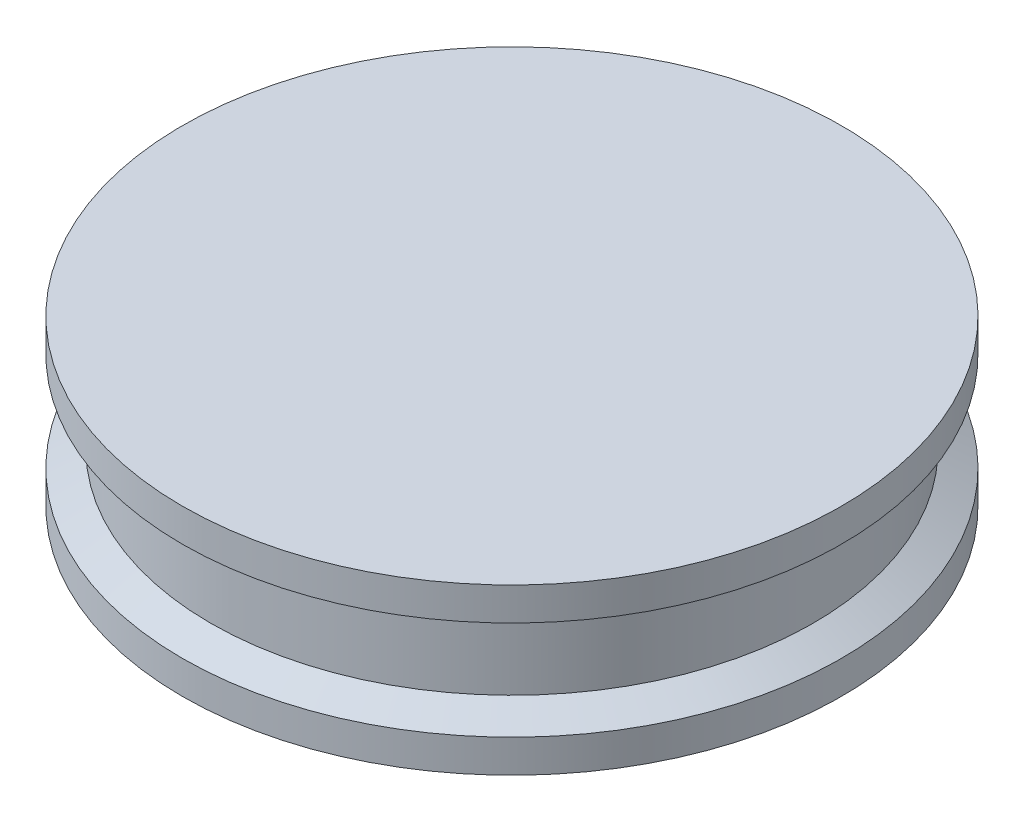
ISO-10303-21;
HEADER;
FILE_DESCRIPTION(('STEP AP214'),'2;1');
FILE_NAME('part.step','',(''),(''),'','','');
FILE_SCHEMA(('AUTOMOTIVE_DESIGN { 1 0 10303 214 1 1 1 1 }'));
ENDSEC;
DATA;
#1=APPLICATION_CONTEXT('core data for automotive mechanical design processes');
#2=APPLICATION_PROTOCOL_DEFINITION('international standard','automotive_design',2000,#1);
#3=PRODUCT_CONTEXT('',#1,'mechanical');
#4=PRODUCT('Part','Part','',(#3));
#5=PRODUCT_RELATED_PRODUCT_CATEGORY('part','',(#4));
#6=PRODUCT_DEFINITION_FORMATION('','',#4);
#7=PRODUCT_DEFINITION_CONTEXT('part definition',#1,'design');
#8=PRODUCT_DEFINITION('design','',#6,#7);
#9=PRODUCT_DEFINITION_SHAPE('','',#8);
#10=(LENGTH_UNIT() NAMED_UNIT(*) SI_UNIT(.MILLI.,.METRE.));
#11=(NAMED_UNIT(*) PLANE_ANGLE_UNIT() SI_UNIT($,.RADIAN.));
#12=(NAMED_UNIT(*) SI_UNIT($,.STERADIAN.) SOLID_ANGLE_UNIT());
#13=UNCERTAINTY_MEASURE_WITH_UNIT(LENGTH_MEASURE(1.E-05),#10,'distance_accuracy_value','');
#14=(GEOMETRIC_REPRESENTATION_CONTEXT(3) GLOBAL_UNCERTAINTY_ASSIGNED_CONTEXT((#13)) GLOBAL_UNIT_ASSIGNED_CONTEXT((#10,
#11,#12)) REPRESENTATION_CONTEXT('',''));
#15=CARTESIAN_POINT('',(0.,0.,0.));
#16=DIRECTION('',(0.,0.,1.));
#17=DIRECTION('',(1.,0.,0.));
#18=AXIS2_PLACEMENT_3D('',#15,#16,#17);
#19=CARTESIAN_POINT('',(0.,5.,0.));
#20=DIRECTION('',(0.,-1.,0.));
#21=DIRECTION('',(0.,0.,-1.));
#22=AXIS2_PLACEMENT_3D('',#19,#20,#21);
#23=CYLINDRICAL_SURFACE('',#22,20.);
#24=CARTESIAN_POINT('',(0.,-5.,0.));
#25=DIRECTION('',(0.,1.,0.));
#26=DIRECTION('',(0.,0.,1.));
#27=AXIS2_PLACEMENT_3D('',#24,#25,#26);
#28=CIRCLE('',#27,20.);
#29=CARTESIAN_POINT('',(0.,-5.,20.));
#30=VERTEX_POINT('',#29);
#31=EDGE_CURVE('E40',#30,#30,#28,.T.);
#32=ORIENTED_EDGE('',*,*,#31,.T.);
#33=EDGE_LOOP('',(#32));
#34=FACE_BOUND('',#33,.T.);
#35=CARTESIAN_POINT('',(0.,-3.,0.));
#36=DIRECTION('',(0.,1.,0.));
#37=DIRECTION('',(0.,0.,1.));
#38=AXIS2_PLACEMENT_3D('',#35,#36,#37);
#39=CIRCLE('',#38,20.);
#40=CARTESIAN_POINT('',(0.,-3.,20.));
#41=VERTEX_POINT('',#40);
#42=EDGE_CURVE('E47',#41,#41,#39,.T.);
#43=ORIENTED_EDGE('',*,*,#42,.F.);
#44=EDGE_LOOP('',(#43));
#45=FACE_BOUND('',#44,.T.);
#46=ADVANCED_FACE('F37',(#34,#45),#23,.T.);
#47=CARTESIAN_POINT('',(0.,-5.,0.));
#48=DIRECTION('',(0.,1.,0.));
#49=DIRECTION('',(0.,0.,1.));
#50=AXIS2_PLACEMENT_3D('',#47,#48,#49);
#51=PLANE('',#50);
#52=ORIENTED_EDGE('',*,*,#31,.F.);
#53=EDGE_LOOP('',(#52));
#54=FACE_BOUND('',#53,.T.);
#55=ADVANCED_FACE('F79',(#54),#51,.F.);
#56=CARTESIAN_POINT('',(0.,-2.00954143238757,0.));
#57=DIRECTION('',(0.,-1.,0.));
#58=DIRECTION('',(0.,0.,-1.));
#59=AXIS2_PLACEMENT_3D('',#56,#57,#58);
#60=CONICAL_SURFACE('',#59,18.2844754381034,1.0471975511966);
#61=ORIENTED_EDGE('',*,*,#42,.T.);
#62=EDGE_LOOP('',(#61));
#63=FACE_BOUND('',#62,.T.);
#64=CARTESIAN_POINT('',(0.,-2.00954143238757,0.));
#65=DIRECTION('',(0.,1.,0.));
#66=DIRECTION('',(0.,0.,1.));
#67=AXIS2_PLACEMENT_3D('',#64,#65,#66);
#68=CIRCLE('',#67,18.2844754381034);
#69=CARTESIAN_POINT('',(0.,-2.00954143238757,18.2844754381034));
#70=VERTEX_POINT('',#69);
#71=EDGE_CURVE('E51',#70,#70,#68,.T.);
#72=ORIENTED_EDGE('',*,*,#71,.F.);
#73=EDGE_LOOP('',(#72));
#74=FACE_BOUND('',#73,.T.);
#75=ADVANCED_FACE('F75',(#63,#74),#60,.T.);
#76=CARTESIAN_POINT('',(0.,7.74776225866702,0.));
#77=DIRECTION('',(0.,1.,0.));
#78=DIRECTION('',(0.,0.,1.));
#79=AXIS2_PLACEMENT_3D('',#76,#77,#78);
#80=CYLINDRICAL_SURFACE('',#79,18.2844754381034);
#81=ORIENTED_EDGE('',*,*,#71,.T.);
#82=EDGE_LOOP('',(#81));
#83=FACE_BOUND('',#82,.T.);
#84=CARTESIAN_POINT('',(0.,2.00954143238757,0.));
#85=DIRECTION('',(0.,1.,0.));
#86=DIRECTION('',(0.,0.,1.));
#87=AXIS2_PLACEMENT_3D('',#84,#85,#86);
#88=CIRCLE('',#87,18.2844754381034);
#89=CARTESIAN_POINT('',(0.,2.00954143238757,18.2844754381034));
#90=VERTEX_POINT('',#89);
#91=EDGE_CURVE('E54',#90,#90,#88,.T.);
#92=ORIENTED_EDGE('',*,*,#91,.F.);
#93=EDGE_LOOP('',(#92));
#94=FACE_BOUND('',#93,.T.);
#95=ADVANCED_FACE('F66',(#83,#94),#80,.T.);
#96=CARTESIAN_POINT('',(0.,3.,0.));
#97=DIRECTION('',(0.,1.,0.));
#98=DIRECTION('',(0.,0.,1.));
#99=AXIS2_PLACEMENT_3D('',#96,#97,#98);
#100=CONICAL_SURFACE('',#99,20.,1.0471975511966);
#101=ORIENTED_EDGE('',*,*,#91,.T.);
#102=EDGE_LOOP('',(#101));
#103=FACE_BOUND('',#102,.T.);
#104=CARTESIAN_POINT('',(0.,3.,0.));
#105=DIRECTION('',(0.,1.,0.));
#106=DIRECTION('',(0.,0.,1.));
#107=AXIS2_PLACEMENT_3D('',#104,#105,#106);
#108=CIRCLE('',#107,20.);
#109=CARTESIAN_POINT('',(0.,3.,20.));
#110=VERTEX_POINT('',#109);
#111=EDGE_CURVE('E57',#110,#110,#108,.T.);
#112=ORIENTED_EDGE('',*,*,#111,.F.);
#113=EDGE_LOOP('',(#112));
#114=FACE_BOUND('',#113,.T.);
#115=ADVANCED_FACE('F63',(#103,#114),#100,.T.);
#116=CARTESIAN_POINT('',(0.,5.,0.));
#117=DIRECTION('',(0.,1.,0.));
#118=DIRECTION('',(0.,0.,1.));
#119=AXIS2_PLACEMENT_3D('',#116,#117,#118);
#120=PLANE('',#119);
#121=CARTESIAN_POINT('',(0.,5.,0.));
#122=DIRECTION('',(0.,1.,0.));
#123=DIRECTION('',(0.,0.,1.));
#124=AXIS2_PLACEMENT_3D('',#121,#122,#123);
#125=CIRCLE('',#124,20.);
#126=CARTESIAN_POINT('',(0.,5.,20.));
#127=VERTEX_POINT('',#126);
#128=EDGE_CURVE('E10',#127,#127,#125,.T.);
#129=ORIENTED_EDGE('',*,*,#128,.T.);
#130=EDGE_LOOP('',(#129));
#131=FACE_BOUND('',#130,.T.);
#132=ADVANCED_FACE('F65',(#131),#120,.T.);
#133=ORIENTED_EDGE('',*,*,#128,.F.);
#134=EDGE_LOOP('',(#133));
#135=FACE_BOUND('',#134,.T.);
#136=ORIENTED_EDGE('',*,*,#111,.T.);
#137=EDGE_LOOP('',(#136));
#138=FACE_BOUND('',#137,.T.);
#139=ADVANCED_FACE('F61',(#135,#138),#23,.T.);
#140=CLOSED_SHELL('',(#46,#55,#75,#95,#115,#132,#139));
#141=MANIFOLD_SOLID_BREP('B2',#140);
#142=ADVANCED_BREP_SHAPE_REPRESENTATION('',(#18,#141),#14);
#143=SHAPE_DEFINITION_REPRESENTATION(#9,#142);
ENDSEC;
END-ISO-10303-21;
